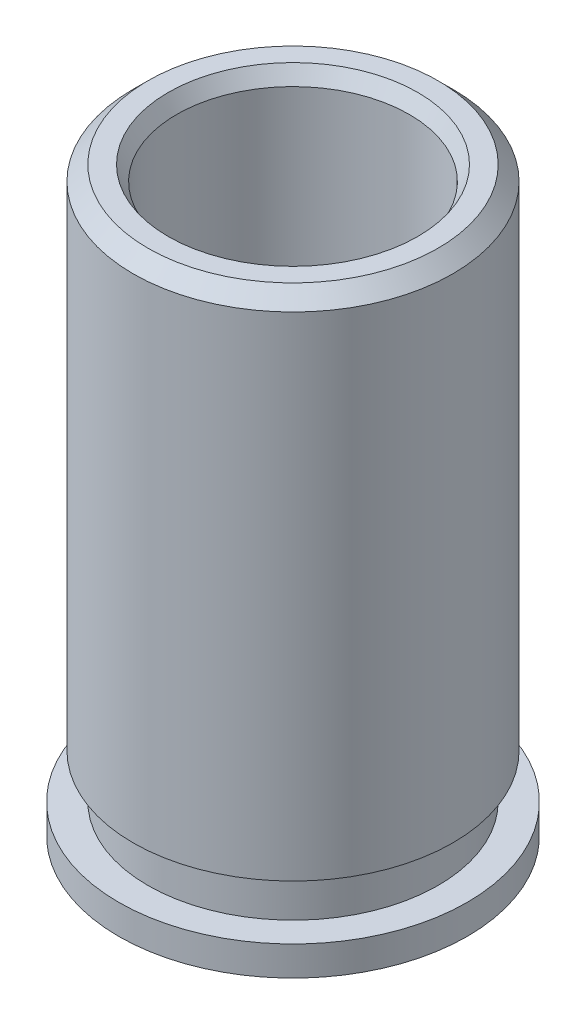
ISO-10303-21;
HEADER;
FILE_DESCRIPTION(('STEP AP214'),'2;1');
FILE_NAME('part.step','',(''),(''),'','','');
FILE_SCHEMA(('AUTOMOTIVE_DESIGN { 1 0 10303 214 1 1 1 1 }'));
ENDSEC;
DATA;
#1=APPLICATION_CONTEXT('core data for automotive mechanical design processes');
#2=APPLICATION_PROTOCOL_DEFINITION('international standard','automotive_design',2000,#1);
#3=PRODUCT_CONTEXT('',#1,'mechanical');
#4=PRODUCT('Part','Part','',(#3));
#5=PRODUCT_RELATED_PRODUCT_CATEGORY('part','',(#4));
#6=PRODUCT_DEFINITION_FORMATION('','',#4);
#7=PRODUCT_DEFINITION_CONTEXT('part definition',#1,'design');
#8=PRODUCT_DEFINITION('design','',#6,#7);
#9=PRODUCT_DEFINITION_SHAPE('','',#8);
#10=(LENGTH_UNIT() NAMED_UNIT(*) SI_UNIT(.MILLI.,.METRE.));
#11=(NAMED_UNIT(*) PLANE_ANGLE_UNIT() SI_UNIT($,.RADIAN.));
#12=(NAMED_UNIT(*) SI_UNIT($,.STERADIAN.) SOLID_ANGLE_UNIT());
#13=UNCERTAINTY_MEASURE_WITH_UNIT(LENGTH_MEASURE(1.E-05),#10,'distance_accuracy_value','');
#14=(GEOMETRIC_REPRESENTATION_CONTEXT(3) GLOBAL_UNCERTAINTY_ASSIGNED_CONTEXT((#13)) GLOBAL_UNIT_ASSIGNED_CONTEXT((#10,
#11,#12)) REPRESENTATION_CONTEXT('',''));
#15=CARTESIAN_POINT('',(0.,0.,0.));
#16=DIRECTION('',(0.,0.,1.));
#17=DIRECTION('',(1.,0.,0.));
#18=AXIS2_PLACEMENT_3D('',#15,#16,#17);
#19=CARTESIAN_POINT('',(7.46743079855605,5.33485359506358,-4.16795604814979));
#20=DIRECTION('',(0.,1.,0.));
#21=DIRECTION('',(0.,0.,1.));
#22=AXIS2_PLACEMENT_3D('',#19,#20,#21);
#23=CYLINDRICAL_SURFACE('',#22,2.9972);
#24=CARTESIAN_POINT('',(7.46743079855605,-4.66514640493642,-4.16795604814979));
#25=DIRECTION('',(0.,1.,0.));
#26=DIRECTION('',(0.,0.,1.));
#27=AXIS2_PLACEMENT_3D('',#24,#25,#26);
#28=CIRCLE('',#27,2.9972);
#29=CARTESIAN_POINT('',(7.46743079855605,-4.66514640493642,-1.17075604814979));
#30=VERTEX_POINT('',#29);
#31=EDGE_CURVE('E50',#30,#30,#28,.T.);
#32=ORIENTED_EDGE('',*,*,#31,.T.);
#33=EDGE_LOOP('',(#32));
#34=FACE_BOUND('',#33,.T.);
#35=CARTESIAN_POINT('',(7.46743079855605,-4.15714640493642,-4.16795604814979));
#36=DIRECTION('',(0.,1.,0.));
#37=DIRECTION('',(0.,0.,1.));
#38=AXIS2_PLACEMENT_3D('',#35,#36,#37);
#39=CIRCLE('',#38,2.9972);
#40=CARTESIAN_POINT('',(7.46743079855605,-4.15714640493642,-1.17075604814979));
#41=VERTEX_POINT('',#40);
#42=EDGE_CURVE('E9',#41,#41,#39,.T.);
#43=ORIENTED_EDGE('',*,*,#42,.F.);
#44=EDGE_LOOP('',(#43));
#45=FACE_BOUND('',#44,.T.);
#46=ADVANCED_FACE('F13',(#34,#45),#23,.T.);
#47=CARTESIAN_POINT('',(7.46743079855605,-4.15714640493642,-4.16795604814979));
#48=DIRECTION('',(0.,1.,0.));
#49=DIRECTION('',(0.,0.,1.));
#50=AXIS2_PLACEMENT_3D('',#47,#48,#49);
#51=PLANE('',#50);
#52=ORIENTED_EDGE('',*,*,#42,.T.);
#53=EDGE_LOOP('',(#52));
#54=FACE_BOUND('',#53,.T.);
#55=CARTESIAN_POINT('',(7.46743079855605,-4.15714640493642,-4.16795604814979));
#56=DIRECTION('',(0.,1.,0.));
#57=DIRECTION('',(0.,0.,1.));
#58=AXIS2_PLACEMENT_3D('',#55,#56,#57);
#59=CIRCLE('',#58,2.49555);
#60=CARTESIAN_POINT('',(7.46743079855605,-4.15714640493642,-1.67240604814979));
#61=VERTEX_POINT('',#60);
#62=EDGE_CURVE('E19',#61,#61,#59,.T.);
#63=ORIENTED_EDGE('',*,*,#62,.F.);
#64=EDGE_LOOP('',(#63));
#65=FACE_BOUND('',#64,.T.);
#66=ADVANCED_FACE('F75',(#54,#65),#51,.T.);
#67=CARTESIAN_POINT('',(7.46743079855605,5.33485359506358,-4.16795604814979));
#68=DIRECTION('',(0.,1.,0.));
#69=DIRECTION('',(0.,0.,1.));
#70=AXIS2_PLACEMENT_3D('',#67,#68,#69);
#71=CYLINDRICAL_SURFACE('',#70,2.49555);
#72=ORIENTED_EDGE('',*,*,#62,.T.);
#73=EDGE_LOOP('',(#72));
#74=FACE_BOUND('',#73,.T.);
#75=CARTESIAN_POINT('',(7.46743079855605,-3.39514640493642,-4.16795604814979));
#76=DIRECTION('',(0.,1.,0.));
#77=DIRECTION('',(0.,0.,1.));
#78=AXIS2_PLACEMENT_3D('',#75,#76,#77);
#79=CIRCLE('',#78,2.49555);
#80=CARTESIAN_POINT('',(7.46743079855605,-3.39514640493642,-1.67240604814979));
#81=VERTEX_POINT('',#80);
#82=EDGE_CURVE('E23',#81,#81,#79,.T.);
#83=ORIENTED_EDGE('',*,*,#82,.F.);
#84=EDGE_LOOP('',(#83));
#85=FACE_BOUND('',#84,.T.);
#86=ADVANCED_FACE('F79',(#74,#85),#71,.T.);
#87=CARTESIAN_POINT('',(7.46743079855604,-3.39514640493642,-4.16795604814979));
#88=DIRECTION('',(0.,-1.,0.));
#89=DIRECTION('',(0.,0.,-1.));
#90=AXIS2_PLACEMENT_3D('',#87,#88,#89);
#91=PLANE('',#90);
#92=ORIENTED_EDGE('',*,*,#82,.T.);
#93=EDGE_LOOP('',(#92));
#94=FACE_BOUND('',#93,.T.);
#95=CARTESIAN_POINT('',(7.46743079855605,-3.39514640493642,-4.16795604814979));
#96=DIRECTION('',(0.,1.,0.));
#97=DIRECTION('',(0.,0.,1.));
#98=AXIS2_PLACEMENT_3D('',#95,#96,#97);
#99=CIRCLE('',#98,2.74955);
#100=CARTESIAN_POINT('',(7.46743079855605,-3.39514640493642,-1.41840604814979));
#101=VERTEX_POINT('',#100);
#102=EDGE_CURVE('E27',#101,#101,#99,.T.);
#103=ORIENTED_EDGE('',*,*,#102,.F.);
#104=EDGE_LOOP('',(#103));
#105=FACE_BOUND('',#104,.T.);
#106=ADVANCED_FACE('F83',(#94,#105),#91,.T.);
#107=CARTESIAN_POINT('',(7.46743079855605,5.33485359506358,-4.16795604814979));
#108=DIRECTION('',(0.,1.,0.));
#109=DIRECTION('',(0.,0.,1.));
#110=AXIS2_PLACEMENT_3D('',#107,#108,#109);
#111=CYLINDRICAL_SURFACE('',#110,2.74955);
#112=ORIENTED_EDGE('',*,*,#102,.T.);
#113=EDGE_LOOP('',(#112));
#114=FACE_BOUND('',#113,.T.);
#115=CARTESIAN_POINT('',(7.46743079855605,5.08085359506358,-4.16795604814979));
#116=DIRECTION('',(0.,1.,0.));
#117=DIRECTION('',(0.,0.,1.));
#118=AXIS2_PLACEMENT_3D('',#115,#116,#117);
#119=CIRCLE('',#118,2.74955);
#120=CARTESIAN_POINT('',(7.46743079855605,5.08085359506358,-1.41840604814979));
#121=VERTEX_POINT('',#120);
#122=EDGE_CURVE('E32',#121,#121,#119,.T.);
#123=ORIENTED_EDGE('',*,*,#122,.F.);
#124=EDGE_LOOP('',(#123));
#125=FACE_BOUND('',#124,.T.);
#126=ADVANCED_FACE('F89',(#114,#125),#111,.T.);
#127=CARTESIAN_POINT('',(7.46743079855605,5.33485359506358,-4.16795604814979));
#128=DIRECTION('',(0.,-1.,0.));
#129=DIRECTION('',(0.,0.,-1.));
#130=AXIS2_PLACEMENT_3D('',#127,#128,#129);
#131=CONICAL_SURFACE('',#130,2.49555,0.785398163397447);
#132=ORIENTED_EDGE('',*,*,#122,.T.);
#133=EDGE_LOOP('',(#132));
#134=FACE_BOUND('',#133,.T.);
#135=CARTESIAN_POINT('',(7.46743079855605,5.33485359506358,-4.16795604814979));
#136=DIRECTION('',(0.,1.,0.));
#137=DIRECTION('',(0.,0.,1.));
#138=AXIS2_PLACEMENT_3D('',#135,#136,#137);
#139=CIRCLE('',#138,2.49555);
#140=CARTESIAN_POINT('',(7.46743079855605,5.33485359506358,-1.67240604814979));
#141=VERTEX_POINT('',#140);
#142=EDGE_CURVE('E35',#141,#141,#139,.T.);
#143=ORIENTED_EDGE('',*,*,#142,.F.);
#144=EDGE_LOOP('',(#143));
#145=FACE_BOUND('',#144,.T.);
#146=ADVANCED_FACE('F93',(#134,#145),#131,.T.);
#147=CARTESIAN_POINT('',(7.46743079855605,5.33485359506358,-4.16795604814979));
#148=DIRECTION('',(0.,1.,0.));
#149=DIRECTION('',(0.,0.,1.));
#150=AXIS2_PLACEMENT_3D('',#147,#148,#149);
#151=PLANE('',#150);
#152=ORIENTED_EDGE('',*,*,#142,.T.);
#153=EDGE_LOOP('',(#152));
#154=FACE_BOUND('',#153,.T.);
#155=CARTESIAN_POINT('',(7.46743079855605,5.33485359506358,-4.16795604814979));
#156=DIRECTION('',(0.,1.,0.));
#157=DIRECTION('',(0.,0.,1.));
#158=AXIS2_PLACEMENT_3D('',#155,#156,#157);
#159=CIRCLE('',#158,2.14664696837416);
#160=CARTESIAN_POINT('',(7.46743079855605,5.33485359506358,-2.02130907977563));
#161=VERTEX_POINT('',#160);
#162=EDGE_CURVE('E38',#161,#161,#159,.T.);
#163=ORIENTED_EDGE('',*,*,#162,.F.);
#164=EDGE_LOOP('',(#163));
#165=FACE_BOUND('',#164,.T.);
#166=ADVANCED_FACE('F97',(#154,#165),#151,.T.);
#167=CARTESIAN_POINT('',(7.46743079855605,5.08085359506358,-4.16795604814979));
#168=DIRECTION('',(0.,1.,0.));
#169=DIRECTION('',(0.,0.,1.));
#170=AXIS2_PLACEMENT_3D('',#167,#168,#169);
#171=CONICAL_SURFACE('',#170,2.,0.523598775598302);
#172=ORIENTED_EDGE('',*,*,#162,.T.);
#173=EDGE_LOOP('',(#172));
#174=FACE_BOUND('',#173,.T.);
#175=CARTESIAN_POINT('',(7.46743079855605,5.08085359506358,-4.16795604814979));
#176=DIRECTION('',(0.,1.,0.));
#177=DIRECTION('',(0.,0.,1.));
#178=AXIS2_PLACEMENT_3D('',#175,#176,#177);
#179=CIRCLE('',#178,2.);
#180=CARTESIAN_POINT('',(7.46743079855605,5.08085359506358,-2.16795604814979));
#181=VERTEX_POINT('',#180);
#182=EDGE_CURVE('E41',#181,#181,#179,.T.);
#183=ORIENTED_EDGE('',*,*,#182,.F.);
#184=EDGE_LOOP('',(#183));
#185=FACE_BOUND('',#184,.T.);
#186=ADVANCED_FACE('F71',(#174,#185),#171,.F.);
#187=CARTESIAN_POINT('',(7.46743079855605,5.33485359506358,-4.16795604814979));
#188=DIRECTION('',(0.,1.,0.));
#189=DIRECTION('',(0.,0.,1.));
#190=AXIS2_PLACEMENT_3D('',#187,#188,#189);
#191=CYLINDRICAL_SURFACE('',#190,2.);
#192=ORIENTED_EDGE('',*,*,#182,.T.);
#193=EDGE_LOOP('',(#192));
#194=FACE_BOUND('',#193,.T.);
#195=CARTESIAN_POINT('',(7.46743079855605,-4.41114640493642,-4.16795604814979));
#196=DIRECTION('',(0.,1.,0.));
#197=DIRECTION('',(0.,0.,1.));
#198=AXIS2_PLACEMENT_3D('',#195,#196,#197);
#199=CIRCLE('',#198,2.);
#200=CARTESIAN_POINT('',(7.46743079855605,-4.41114640493642,-2.16795604814979));
#201=VERTEX_POINT('',#200);
#202=EDGE_CURVE('E44',#201,#201,#199,.T.);
#203=ORIENTED_EDGE('',*,*,#202,.F.);
#204=EDGE_LOOP('',(#203));
#205=FACE_BOUND('',#204,.T.);
#206=ADVANCED_FACE('F64',(#194,#205),#191,.F.);
#207=CARTESIAN_POINT('',(7.46743079855605,-4.66514640493642,-4.16795604814979));
#208=DIRECTION('',(0.,-1.,0.));
#209=DIRECTION('',(0.,0.,-1.));
#210=AXIS2_PLACEMENT_3D('',#207,#208,#209);
#211=CONICAL_SURFACE('',#210,2.14664696837417,0.523598775598302);
#212=ORIENTED_EDGE('',*,*,#202,.T.);
#213=EDGE_LOOP('',(#212));
#214=FACE_BOUND('',#213,.T.);
#215=CARTESIAN_POINT('',(7.46743079855605,-4.66514640493642,-4.16795604814979));
#216=DIRECTION('',(0.,1.,0.));
#217=DIRECTION('',(0.,0.,1.));
#218=AXIS2_PLACEMENT_3D('',#215,#216,#217);
#219=CIRCLE('',#218,2.14664696837417);
#220=CARTESIAN_POINT('',(7.46743079855605,-4.66514640493642,-2.02130907977562));
#221=VERTEX_POINT('',#220);
#222=EDGE_CURVE('E47',#221,#221,#219,.T.);
#223=ORIENTED_EDGE('',*,*,#222,.F.);
#224=EDGE_LOOP('',(#223));
#225=FACE_BOUND('',#224,.T.);
#226=ADVANCED_FACE('F59',(#214,#225),#211,.F.);
#227=CARTESIAN_POINT('',(7.46743079855605,-4.66514640493642,-4.16795604814979));
#228=DIRECTION('',(0.,1.,0.));
#229=DIRECTION('',(0.,0.,1.));
#230=AXIS2_PLACEMENT_3D('',#227,#228,#229);
#231=PLANE('',#230);
#232=ORIENTED_EDGE('',*,*,#31,.F.);
#233=EDGE_LOOP('',(#232));
#234=FACE_BOUND('',#233,.T.);
#235=ORIENTED_EDGE('',*,*,#222,.T.);
#236=EDGE_LOOP('',(#235));
#237=FACE_BOUND('',#236,.T.);
#238=ADVANCED_FACE('F56',(#234,#237),#231,.F.);
#239=CLOSED_SHELL('',(#46,#66,#86,#106,#126,#146,#166,#186,#206,#226,#238));
#240=MANIFOLD_SOLID_BREP('B1',#239);
#241=ADVANCED_BREP_SHAPE_REPRESENTATION('',(#18,#240),#14);
#242=SHAPE_DEFINITION_REPRESENTATION(#9,#241);
ENDSEC;
END-ISO-10303-21;
